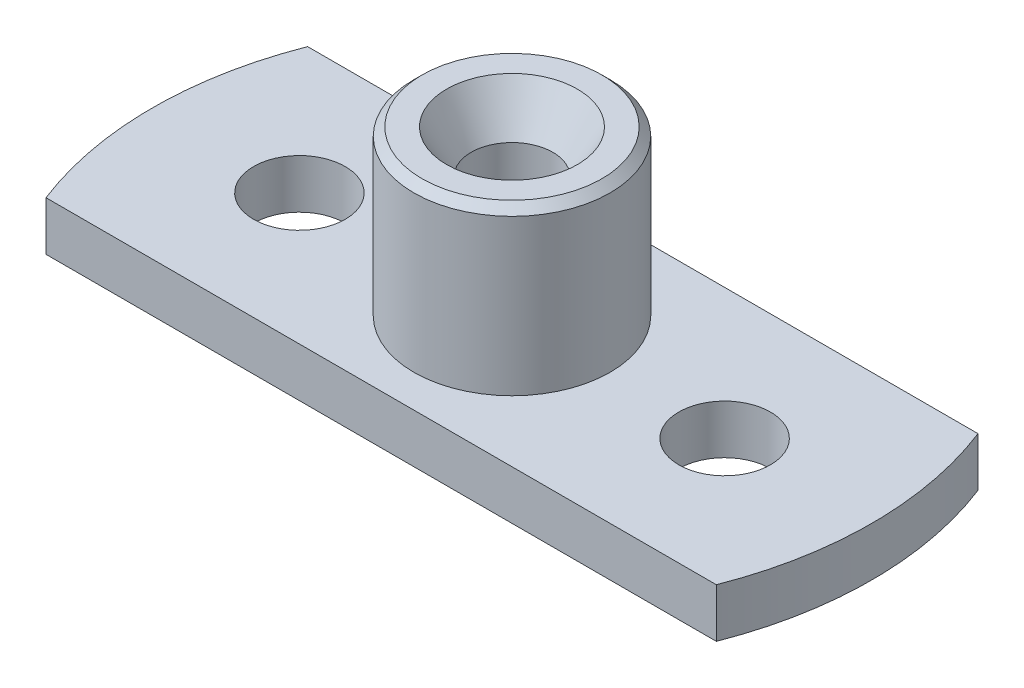
ISO-10303-21;
HEADER;
FILE_DESCRIPTION(('STEP AP214'),'2;1');
FILE_NAME('part.step','',(''),(''),'','','');
FILE_SCHEMA(('AUTOMOTIVE_DESIGN { 1 0 10303 214 1 1 1 1 }'));
ENDSEC;
DATA;
#1=APPLICATION_CONTEXT('core data for automotive mechanical design processes');
#2=APPLICATION_PROTOCOL_DEFINITION('international standard','automotive_design',2000,#1);
#3=PRODUCT_CONTEXT('',#1,'mechanical');
#4=PRODUCT('Part','Part','',(#3));
#5=PRODUCT_RELATED_PRODUCT_CATEGORY('part','',(#4));
#6=PRODUCT_DEFINITION_FORMATION('','',#4);
#7=PRODUCT_DEFINITION_CONTEXT('part definition',#1,'design');
#8=PRODUCT_DEFINITION('design','',#6,#7);
#9=PRODUCT_DEFINITION_SHAPE('','',#8);
#10=(LENGTH_UNIT() NAMED_UNIT(*) SI_UNIT(.MILLI.,.METRE.));
#11=(NAMED_UNIT(*) PLANE_ANGLE_UNIT() SI_UNIT($,.RADIAN.));
#12=(NAMED_UNIT(*) SI_UNIT($,.STERADIAN.) SOLID_ANGLE_UNIT());
#13=UNCERTAINTY_MEASURE_WITH_UNIT(LENGTH_MEASURE(1.E-05),#10,'distance_accuracy_value','');
#14=(GEOMETRIC_REPRESENTATION_CONTEXT(3) GLOBAL_UNCERTAINTY_ASSIGNED_CONTEXT((#13)) GLOBAL_UNIT_ASSIGNED_CONTEXT((#10,
#11,#12)) REPRESENTATION_CONTEXT('',''));
#15=CARTESIAN_POINT('',(0.,0.,0.));
#16=DIRECTION('',(0.,0.,1.));
#17=DIRECTION('',(1.,0.,0.));
#18=AXIS2_PLACEMENT_3D('',#15,#16,#17);
#19=CARTESIAN_POINT('',(0.,1.5,0.));
#20=DIRECTION('',(0.,-1.,0.));
#21=DIRECTION('',(0.,0.,-1.));
#22=AXIS2_PLACEMENT_3D('',#19,#20,#21);
#23=CYLINDRICAL_SURFACE('',#22,11.);
#24=CARTESIAN_POINT('',(0.,0.,0.));
#25=DIRECTION('',(0.,1.,0.));
#26=DIRECTION('',(0.,0.,1.));
#27=AXIS2_PLACEMENT_3D('',#24,#25,#26);
#28=CIRCLE('',#27,11.);
#29=CARTESIAN_POINT('',(-10.2469507659596,0.,-4.));
#30=VERTEX_POINT('',#29);
#31=CARTESIAN_POINT('',(-10.2469507659596,0.,4.));
#32=VERTEX_POINT('',#31);
#33=EDGE_CURVE('E107',#30,#32,#28,.T.);
#34=ORIENTED_EDGE('',*,*,#33,.T.);
#35=DIRECTION('',(0.,-1.,0.));
#36=VECTOR('',#35,1.);
#37=CARTESIAN_POINT('',(-10.2469507659596,1.5,4.));
#38=LINE('',#37,#36);
#39=CARTESIAN_POINT('',(-10.2469507659596,1.5,4.));
#40=VERTEX_POINT('',#39);
#41=EDGE_CURVE('E99',#40,#32,#38,.T.);
#42=ORIENTED_EDGE('',*,*,#41,.F.);
#43=CARTESIAN_POINT('',(0.,1.5,0.));
#44=DIRECTION('',(0.,1.,0.));
#45=DIRECTION('',(0.,0.,1.));
#46=AXIS2_PLACEMENT_3D('',#43,#44,#45);
#47=CIRCLE('',#46,11.);
#48=CARTESIAN_POINT('',(-10.2469507659596,1.5,-4.));
#49=VERTEX_POINT('',#48);
#50=EDGE_CURVE('E90',#49,#40,#47,.T.);
#51=ORIENTED_EDGE('',*,*,#50,.F.);
#52=DIRECTION('',(0.,-1.,0.));
#53=VECTOR('',#52,1.);
#54=CARTESIAN_POINT('',(-10.2469507659596,1.5,-4.));
#55=LINE('',#54,#53);
#56=EDGE_CURVE('E56',#49,#30,#55,.T.);
#57=ORIENTED_EDGE('',*,*,#56,.T.);
#58=EDGE_LOOP('',(#34,#42,#51,#57));
#59=FACE_BOUND('',#58,.T.);
#60=ADVANCED_FACE('F38',(#59),#23,.T.);
#61=CARTESIAN_POINT('',(0.,1.5,4.));
#62=DIRECTION('',(0.,0.,-1.));
#63=DIRECTION('',(-1.,0.,0.));
#64=AXIS2_PLACEMENT_3D('',#61,#62,#63);
#65=PLANE('',#64);
#66=DIRECTION('',(1.,0.,0.));
#67=VECTOR('',#66,1.);
#68=CARTESIAN_POINT('',(0.,0.,4.));
#69=LINE('',#68,#67);
#70=CARTESIAN_POINT('',(10.2469507659596,0.,4.));
#71=VERTEX_POINT('',#70);
#72=EDGE_CURVE('E96',#32,#71,#69,.T.);
#73=ORIENTED_EDGE('',*,*,#72,.T.);
#74=DIRECTION('',(0.,-1.,0.));
#75=VECTOR('',#74,1.);
#76=CARTESIAN_POINT('',(10.2469507659596,1.5,4.));
#77=LINE('',#76,#75);
#78=CARTESIAN_POINT('',(10.2469507659596,1.5,4.));
#79=VERTEX_POINT('',#78);
#80=EDGE_CURVE('E94',#79,#71,#77,.T.);
#81=ORIENTED_EDGE('',*,*,#80,.F.);
#82=DIRECTION('',(1.,0.,0.));
#83=VECTOR('',#82,1.);
#84=CARTESIAN_POINT('',(0.,1.5,4.));
#85=LINE('',#84,#83);
#86=EDGE_CURVE('E83',#40,#79,#85,.T.);
#87=ORIENTED_EDGE('',*,*,#86,.F.);
#88=ORIENTED_EDGE('',*,*,#41,.T.);
#89=EDGE_LOOP('',(#73,#81,#87,#88));
#90=FACE_BOUND('',#89,.T.);
#91=ADVANCED_FACE('F95',(#90),#65,.F.);
#92=CARTESIAN_POINT('',(0.,1.5,0.));
#93=DIRECTION('',(0.,-1.,0.));
#94=DIRECTION('',(0.,0.,-1.));
#95=AXIS2_PLACEMENT_3D('',#92,#93,#94);
#96=CYLINDRICAL_SURFACE('',#95,11.);
#97=CARTESIAN_POINT('',(0.,0.,0.));
#98=DIRECTION('',(0.,1.,0.));
#99=DIRECTION('',(0.,0.,1.));
#100=AXIS2_PLACEMENT_3D('',#97,#98,#99);
#101=CIRCLE('',#100,11.);
#102=CARTESIAN_POINT('',(10.2469507659596,0.,-4.));
#103=VERTEX_POINT('',#102);
#104=EDGE_CURVE('E111',#71,#103,#101,.T.);
#105=ORIENTED_EDGE('',*,*,#104,.T.);
#106=DIRECTION('',(0.,-1.,0.));
#107=VECTOR('',#106,1.);
#108=CARTESIAN_POINT('',(10.2469507659596,1.5,-4.));
#109=LINE('',#108,#107);
#110=CARTESIAN_POINT('',(10.2469507659596,1.5,-4.));
#111=VERTEX_POINT('',#110);
#112=EDGE_CURVE('E71',#111,#103,#109,.T.);
#113=ORIENTED_EDGE('',*,*,#112,.F.);
#114=CARTESIAN_POINT('',(0.,1.5,0.));
#115=DIRECTION('',(0.,1.,0.));
#116=DIRECTION('',(0.,0.,1.));
#117=AXIS2_PLACEMENT_3D('',#114,#115,#116);
#118=CIRCLE('',#117,11.);
#119=EDGE_CURVE('E89',#79,#111,#118,.T.);
#120=ORIENTED_EDGE('',*,*,#119,.F.);
#121=ORIENTED_EDGE('',*,*,#80,.T.);
#122=EDGE_LOOP('',(#105,#113,#120,#121));
#123=FACE_BOUND('',#122,.T.);
#124=ADVANCED_FACE('F101',(#123),#96,.T.);
#125=CARTESIAN_POINT('',(0.,1.5,-4.));
#126=DIRECTION('',(0.,0.,-1.));
#127=DIRECTION('',(-1.,0.,0.));
#128=AXIS2_PLACEMENT_3D('',#125,#126,#127);
#129=PLANE('',#128);
#130=DIRECTION('',(1.,0.,0.));
#131=VECTOR('',#130,1.);
#132=CARTESIAN_POINT('',(0.,0.,-4.));
#133=LINE('',#132,#131);
#134=EDGE_CURVE('E113',#30,#103,#133,.T.);
#135=ORIENTED_EDGE('',*,*,#134,.F.);
#136=ORIENTED_EDGE('',*,*,#56,.F.);
#137=DIRECTION('',(1.,0.,0.));
#138=VECTOR('',#137,1.);
#139=CARTESIAN_POINT('',(0.,1.5,-4.));
#140=LINE('',#139,#138);
#141=EDGE_CURVE('E102',#49,#111,#140,.T.);
#142=ORIENTED_EDGE('',*,*,#141,.T.);
#143=ORIENTED_EDGE('',*,*,#112,.T.);
#144=EDGE_LOOP('',(#135,#136,#142,#143));
#145=FACE_BOUND('',#144,.T.);
#146=ADVANCED_FACE('F179',(#145),#129,.T.);
#147=CARTESIAN_POINT('',(0.,1.5,0.));
#148=DIRECTION('',(0.,1.,0.));
#149=DIRECTION('',(0.,0.,1.));
#150=AXIS2_PLACEMENT_3D('',#147,#148,#149);
#151=PLANE('',#150);
#152=CARTESIAN_POINT('',(-6.5,1.5,0.));
#153=DIRECTION('',(0.,1.,0.));
#154=DIRECTION('',(0.,0.,1.));
#155=AXIS2_PLACEMENT_3D('',#152,#153,#154);
#156=CIRCLE('',#155,1.39999999999999);
#157=CARTESIAN_POINT('',(-6.5,1.5,1.39999999999999));
#158=VERTEX_POINT('',#157);
#159=EDGE_CURVE('E136',#158,#158,#156,.T.);
#160=ORIENTED_EDGE('',*,*,#159,.F.);
#161=EDGE_LOOP('',(#160));
#162=FACE_BOUND('',#161,.T.);
#163=CARTESIAN_POINT('',(6.5,1.5,0.));
#164=DIRECTION('',(0.,1.,0.));
#165=DIRECTION('',(0.,0.,1.));
#166=AXIS2_PLACEMENT_3D('',#163,#164,#165);
#167=CIRCLE('',#166,1.39999999999999);
#168=CARTESIAN_POINT('',(6.5,1.5,1.39999999999999));
#169=VERTEX_POINT('',#168);
#170=EDGE_CURVE('E130',#169,#169,#167,.T.);
#171=ORIENTED_EDGE('',*,*,#170,.F.);
#172=EDGE_LOOP('',(#171));
#173=FACE_BOUND('',#172,.T.);
#174=CARTESIAN_POINT('',(0.,1.5,0.));
#175=DIRECTION('',(0.,1.,0.));
#176=DIRECTION('',(0.,0.,1.));
#177=AXIS2_PLACEMENT_3D('',#174,#175,#176);
#178=CIRCLE('',#177,3.);
#179=CARTESIAN_POINT('',(0.,1.5,3.));
#180=VERTEX_POINT('',#179);
#181=EDGE_CURVE('E119',#180,#180,#178,.T.);
#182=ORIENTED_EDGE('',*,*,#181,.F.);
#183=EDGE_LOOP('',(#182));
#184=FACE_BOUND('',#183,.T.);
#185=ORIENTED_EDGE('',*,*,#50,.T.);
#186=ORIENTED_EDGE('',*,*,#86,.T.);
#187=ORIENTED_EDGE('',*,*,#119,.T.);
#188=ORIENTED_EDGE('',*,*,#141,.F.);
#189=EDGE_LOOP('',(#185,#186,#187,#188));
#190=FACE_BOUND('',#189,.T.);
#191=ADVANCED_FACE('F86',(#162,#173,#184,#190),#151,.T.);
#192=CARTESIAN_POINT('',(0.,0.,0.));
#193=DIRECTION('',(0.,1.,0.));
#194=DIRECTION('',(0.,0.,1.));
#195=AXIS2_PLACEMENT_3D('',#192,#193,#194);
#196=PLANE('',#195);
#197=CARTESIAN_POINT('',(0.,0.,0.));
#198=DIRECTION('',(0.,1.,0.));
#199=DIRECTION('',(0.,0.,1.));
#200=AXIS2_PLACEMENT_3D('',#197,#198,#199);
#201=CIRCLE('',#200,2.5);
#202=CARTESIAN_POINT('',(0.,0.,2.5));
#203=VERTEX_POINT('',#202);
#204=EDGE_CURVE('E145',#203,#203,#201,.T.);
#205=ORIENTED_EDGE('',*,*,#204,.T.);
#206=EDGE_LOOP('',(#205));
#207=FACE_BOUND('',#206,.T.);
#208=CARTESIAN_POINT('',(-6.5,0.,0.));
#209=DIRECTION('',(0.,1.,0.));
#210=DIRECTION('',(0.,0.,1.));
#211=AXIS2_PLACEMENT_3D('',#208,#209,#210);
#212=CIRCLE('',#211,1.4);
#213=CARTESIAN_POINT('',(-6.5,0.,1.4));
#214=VERTEX_POINT('',#213);
#215=EDGE_CURVE('E133',#214,#214,#212,.T.);
#216=ORIENTED_EDGE('',*,*,#215,.T.);
#217=EDGE_LOOP('',(#216));
#218=FACE_BOUND('',#217,.T.);
#219=CARTESIAN_POINT('',(6.5,0.,0.));
#220=DIRECTION('',(0.,1.,0.));
#221=DIRECTION('',(0.,0.,1.));
#222=AXIS2_PLACEMENT_3D('',#219,#220,#221);
#223=CIRCLE('',#222,1.4);
#224=CARTESIAN_POINT('',(6.5,0.,1.4));
#225=VERTEX_POINT('',#224);
#226=EDGE_CURVE('E109',#225,#225,#223,.T.);
#227=ORIENTED_EDGE('',*,*,#226,.T.);
#228=EDGE_LOOP('',(#227));
#229=FACE_BOUND('',#228,.T.);
#230=ORIENTED_EDGE('',*,*,#33,.F.);
#231=ORIENTED_EDGE('',*,*,#134,.T.);
#232=ORIENTED_EDGE('',*,*,#104,.F.);
#233=ORIENTED_EDGE('',*,*,#72,.F.);
#234=EDGE_LOOP('',(#230,#231,#232,#233));
#235=FACE_BOUND('',#234,.T.);
#236=ADVANCED_FACE('F182',(#207,#218,#229,#235),#196,.F.);
#237=CARTESIAN_POINT('',(0.,6.5,0.));
#238=DIRECTION('',(0.,-1.,0.));
#239=DIRECTION('',(0.,0.,-1.));
#240=AXIS2_PLACEMENT_3D('',#237,#238,#239);
#241=CYLINDRICAL_SURFACE('',#240,3.);
#242=CARTESIAN_POINT('',(0.,6.25,0.));
#243=DIRECTION('',(0.,1.,0.));
#244=DIRECTION('',(0.,0.,1.));
#245=AXIS2_PLACEMENT_3D('',#242,#243,#244);
#246=CIRCLE('',#245,3.);
#247=CARTESIAN_POINT('',(0.,6.25,3.));
#248=VERTEX_POINT('',#247);
#249=EDGE_CURVE('E11',#248,#248,#246,.F.);
#250=ORIENTED_EDGE('',*,*,#249,.T.);
#251=EDGE_LOOP('',(#250));
#252=FACE_BOUND('',#251,.T.);
#253=ORIENTED_EDGE('',*,*,#181,.T.);
#254=EDGE_LOOP('',(#253));
#255=FACE_BOUND('',#254,.T.);
#256=ADVANCED_FACE('F185',(#252,#255),#241,.T.);
#257=CARTESIAN_POINT('',(0.,6.5,0.));
#258=DIRECTION('',(0.,1.,0.));
#259=DIRECTION('',(0.,0.,1.));
#260=AXIS2_PLACEMENT_3D('',#257,#258,#259);
#261=PLANE('',#260);
#262=CARTESIAN_POINT('',(0.,6.5,0.));
#263=DIRECTION('',(0.,1.,0.));
#264=DIRECTION('',(0.,0.,1.));
#265=AXIS2_PLACEMENT_3D('',#262,#263,#264);
#266=CIRCLE('',#265,2.);
#267=CARTESIAN_POINT('',(0.,6.5,2.));
#268=VERTEX_POINT('',#267);
#269=EDGE_CURVE('E142',#268,#268,#266,.T.);
#270=ORIENTED_EDGE('',*,*,#269,.F.);
#271=EDGE_LOOP('',(#270));
#272=FACE_BOUND('',#271,.T.);
#273=CARTESIAN_POINT('',(0.,6.5,0.));
#274=DIRECTION('',(0.,1.,0.));
#275=DIRECTION('',(0.,0.,1.));
#276=AXIS2_PLACEMENT_3D('',#273,#274,#275);
#277=CIRCLE('',#276,2.75);
#278=CARTESIAN_POINT('',(0.,6.5,2.75));
#279=VERTEX_POINT('',#278);
#280=EDGE_CURVE('E48',#279,#279,#277,.T.);
#281=ORIENTED_EDGE('',*,*,#280,.T.);
#282=EDGE_LOOP('',(#281));
#283=FACE_BOUND('',#282,.T.);
#284=ADVANCED_FACE('F192',(#272,#283),#261,.T.);
#285=CARTESIAN_POINT('',(6.5,1.5,0.));
#286=DIRECTION('',(0.,1.,0.));
#287=DIRECTION('',(0.,0.,1.));
#288=AXIS2_PLACEMENT_3D('',#285,#286,#287);
#289=CYLINDRICAL_SURFACE('',#288,1.39999999999999);
#290=ORIENTED_EDGE('',*,*,#226,.F.);
#291=EDGE_LOOP('',(#290));
#292=FACE_BOUND('',#291,.T.);
#293=ORIENTED_EDGE('',*,*,#170,.T.);
#294=EDGE_LOOP('',(#293));
#295=FACE_BOUND('',#294,.T.);
#296=ADVANCED_FACE('F196',(#292,#295),#289,.F.);
#297=CARTESIAN_POINT('',(-6.5,1.5,0.));
#298=DIRECTION('',(0.,1.,0.));
#299=DIRECTION('',(0.,0.,1.));
#300=AXIS2_PLACEMENT_3D('',#297,#298,#299);
#301=CYLINDRICAL_SURFACE('',#300,1.39999999999999);
#302=ORIENTED_EDGE('',*,*,#215,.F.);
#303=EDGE_LOOP('',(#302));
#304=FACE_BOUND('',#303,.T.);
#305=ORIENTED_EDGE('',*,*,#159,.T.);
#306=EDGE_LOOP('',(#305));
#307=FACE_BOUND('',#306,.T.);
#308=ADVANCED_FACE('F200',(#304,#307),#301,.F.);
#309=CARTESIAN_POINT('',(0.,6.5,0.));
#310=DIRECTION('',(0.,-1.,0.));
#311=DIRECTION('',(0.,0.,-1.));
#312=AXIS2_PLACEMENT_3D('',#309,#310,#311);
#313=CONICAL_SURFACE('',#312,2.75,0.785398163397445);
#314=ORIENTED_EDGE('',*,*,#249,.F.);
#315=EDGE_LOOP('',(#314));
#316=FACE_BOUND('',#315,.T.);
#317=ORIENTED_EDGE('',*,*,#280,.F.);
#318=EDGE_LOOP('',(#317));
#319=FACE_BOUND('',#318,.T.);
#320=ADVANCED_FACE('F40',(#316,#319),#313,.T.);
#321=CARTESIAN_POINT('',(0.,6.5,0.));
#322=DIRECTION('',(0.,1.,0.));
#323=DIRECTION('',(0.,0.,1.));
#324=AXIS2_PLACEMENT_3D('',#321,#322,#323);
#325=CYLINDRICAL_SURFACE('',#324,1.25);
#326=CARTESIAN_POINT('',(0.,0.7,0.));
#327=DIRECTION('',(0.,1.,0.));
#328=DIRECTION('',(0.,0.,1.));
#329=AXIS2_PLACEMENT_3D('',#326,#327,#328);
#330=CIRCLE('',#329,1.25);
#331=CARTESIAN_POINT('',(0.,0.7,1.25));
#332=VERTEX_POINT('',#331);
#333=EDGE_CURVE('E42',#332,#332,#330,.F.);
#334=ORIENTED_EDGE('',*,*,#333,.T.);
#335=EDGE_LOOP('',(#334));
#336=FACE_BOUND('',#335,.T.);
#337=CARTESIAN_POINT('',(0.,5.20096189432334,0.));
#338=DIRECTION('',(0.,1.,0.));
#339=DIRECTION('',(0.,0.,1.));
#340=AXIS2_PLACEMENT_3D('',#337,#338,#339);
#341=CIRCLE('',#340,1.25);
#342=CARTESIAN_POINT('',(0.,5.20096189432334,1.25));
#343=VERTEX_POINT('',#342);
#344=EDGE_CURVE('E139',#343,#343,#341,.T.);
#345=ORIENTED_EDGE('',*,*,#344,.T.);
#346=EDGE_LOOP('',(#345));
#347=FACE_BOUND('',#346,.T.);
#348=ADVANCED_FACE('F155',(#336,#347),#325,.F.);
#349=CARTESIAN_POINT('',(0.,6.5,0.));
#350=DIRECTION('',(0.,1.,0.));
#351=DIRECTION('',(0.,0.,1.));
#352=AXIS2_PLACEMENT_3D('',#349,#350,#351);
#353=CONICAL_SURFACE('',#352,2.,0.523598775598299);
#354=ORIENTED_EDGE('',*,*,#344,.F.);
#355=EDGE_LOOP('',(#354));
#356=FACE_BOUND('',#355,.T.);
#357=ORIENTED_EDGE('',*,*,#269,.T.);
#358=EDGE_LOOP('',(#357));
#359=FACE_BOUND('',#358,.T.);
#360=ADVANCED_FACE('F161',(#356,#359),#353,.F.);
#361=CARTESIAN_POINT('',(0.,0.7,0.));
#362=DIRECTION('',(0.,1.,0.));
#363=DIRECTION('',(0.,0.,1.));
#364=AXIS2_PLACEMENT_3D('',#361,#362,#363);
#365=PLANE('',#364);
#366=CARTESIAN_POINT('',(0.,0.7,0.));
#367=DIRECTION('',(0.,1.,0.));
#368=DIRECTION('',(0.,0.,1.));
#369=AXIS2_PLACEMENT_3D('',#366,#367,#368);
#370=CIRCLE('',#369,2.5);
#371=CARTESIAN_POINT('',(0.,0.7,2.5));
#372=VERTEX_POINT('',#371);
#373=EDGE_CURVE('E148',#372,#372,#370,.T.);
#374=ORIENTED_EDGE('',*,*,#373,.F.);
#375=EDGE_LOOP('',(#374));
#376=FACE_BOUND('',#375,.T.);
#377=ORIENTED_EDGE('',*,*,#333,.F.);
#378=EDGE_LOOP('',(#377));
#379=FACE_BOUND('',#378,.T.);
#380=ADVANCED_FACE('F158',(#376,#379),#365,.F.);
#381=CARTESIAN_POINT('',(0.,0.7,0.));
#382=DIRECTION('',(0.,-1.,0.));
#383=DIRECTION('',(0.,0.,-1.));
#384=AXIS2_PLACEMENT_3D('',#381,#382,#383);
#385=CYLINDRICAL_SURFACE('',#384,2.5);
#386=ORIENTED_EDGE('',*,*,#373,.T.);
#387=EDGE_LOOP('',(#386));
#388=FACE_BOUND('',#387,.T.);
#389=ORIENTED_EDGE('',*,*,#204,.F.);
#390=EDGE_LOOP('',(#389));
#391=FACE_BOUND('',#390,.T.);
#392=ADVANCED_FACE('F160',(#388,#391),#385,.F.);
#393=CLOSED_SHELL('',(#60,#91,#124,#146,#191,#236,#256,#284,#296,#308,#320,#348,#360,#380,#392));
#394=MANIFOLD_SOLID_BREP('B2',#393);
#395=ADVANCED_BREP_SHAPE_REPRESENTATION('',(#18,#394),#14);
#396=SHAPE_DEFINITION_REPRESENTATION(#9,#395);
ENDSEC;
END-ISO-10303-21;
